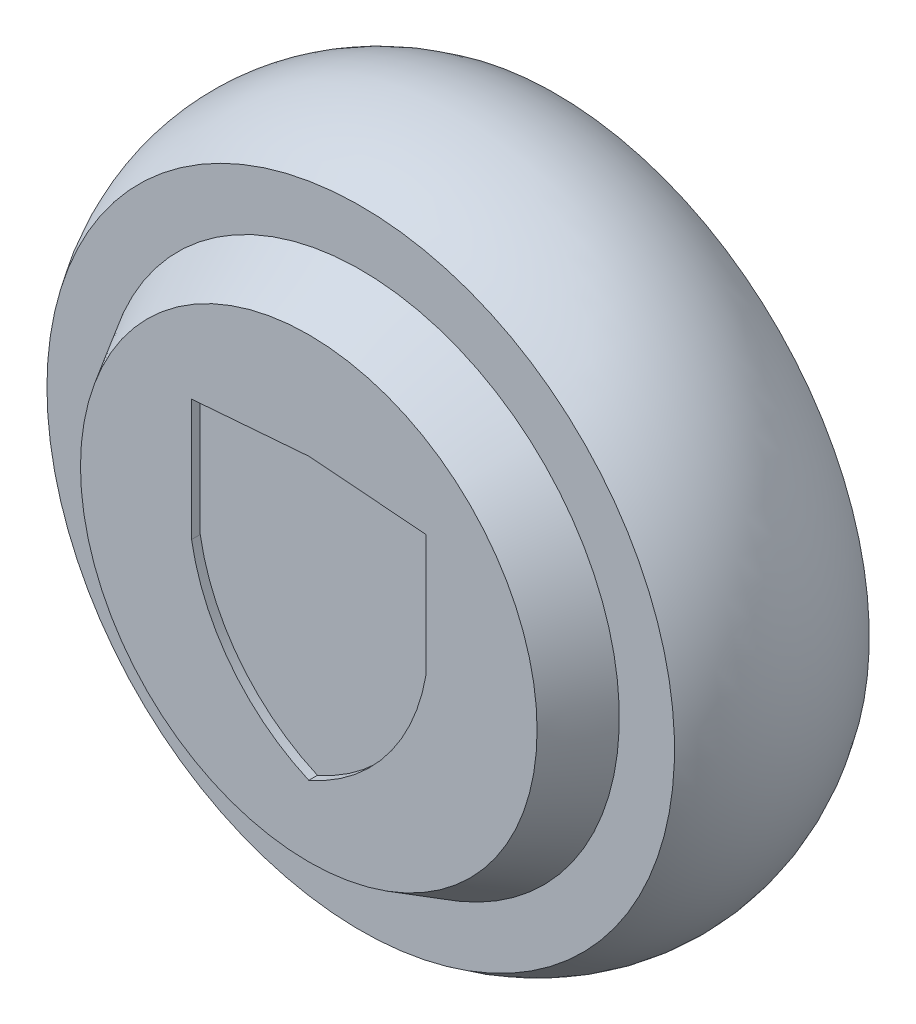
ISO-10303-21;
HEADER;
FILE_DESCRIPTION(('STEP AP214'),'2;1');
FILE_NAME('part.step','',(''),(''),'','','');
FILE_SCHEMA(('AUTOMOTIVE_DESIGN { 1 0 10303 214 1 1 1 1 }'));
ENDSEC;
DATA;
#1=APPLICATION_CONTEXT('core data for automotive mechanical design processes');
#2=APPLICATION_PROTOCOL_DEFINITION('international standard','automotive_design',2000,#1);
#3=PRODUCT_CONTEXT('',#1,'mechanical');
#4=PRODUCT('Part','Part','',(#3));
#5=PRODUCT_RELATED_PRODUCT_CATEGORY('part','',(#4));
#6=PRODUCT_DEFINITION_FORMATION('','',#4);
#7=PRODUCT_DEFINITION_CONTEXT('part definition',#1,'design');
#8=PRODUCT_DEFINITION('design','',#6,#7);
#9=PRODUCT_DEFINITION_SHAPE('','',#8);
#10=(LENGTH_UNIT() NAMED_UNIT(*) SI_UNIT(.MILLI.,.METRE.));
#11=(NAMED_UNIT(*) PLANE_ANGLE_UNIT() SI_UNIT($,.RADIAN.));
#12=(NAMED_UNIT(*) SI_UNIT($,.STERADIAN.) SOLID_ANGLE_UNIT());
#13=UNCERTAINTY_MEASURE_WITH_UNIT(LENGTH_MEASURE(1.E-05),#10,'distance_accuracy_value','');
#14=(GEOMETRIC_REPRESENTATION_CONTEXT(3) GLOBAL_UNCERTAINTY_ASSIGNED_CONTEXT((#13)) GLOBAL_UNIT_ASSIGNED_CONTEXT((#10,
#11,#12)) REPRESENTATION_CONTEXT('',''));
#15=CARTESIAN_POINT('',(0.,0.,0.));
#16=DIRECTION('',(0.,0.,1.));
#17=DIRECTION('',(1.,0.,0.));
#18=AXIS2_PLACEMENT_3D('',#15,#16,#17);
#19=CARTESIAN_POINT('',(0.,0.,-22.5));
#20=DIRECTION('',(0.,0.,1.));
#21=DIRECTION('',(1.,0.,0.));
#22=AXIS2_PLACEMENT_3D('',#19,#20,#21);
#23=PLANE('',#22);
#24=CARTESIAN_POINT('',(0.,0.,-22.5));
#25=DIRECTION('',(0.,0.,-1.));
#26=DIRECTION('',(-1.,0.,0.));
#27=AXIS2_PLACEMENT_3D('',#24,#25,#26);
#28=CIRCLE('',#27,67.5);
#29=CARTESIAN_POINT('',(-67.5,0.,-22.5));
#30=VERTEX_POINT('',#29);
#31=EDGE_CURVE('E155',#30,#30,#28,.T.);
#32=ORIENTED_EDGE('',*,*,#31,.F.);
#33=EDGE_LOOP('',(#32));
#34=FACE_BOUND('',#33,.T.);
#35=CARTESIAN_POINT('',(0.,0.,-22.5));
#36=DIRECTION('',(0.,0.,-1.));
#37=DIRECTION('',(-1.,0.,0.));
#38=AXIS2_PLACEMENT_3D('',#35,#36,#37);
#39=CIRCLE('',#38,72.5);
#40=CARTESIAN_POINT('',(-72.5,0.,-22.5));
#41=VERTEX_POINT('',#40);
#42=EDGE_CURVE('E148',#41,#41,#39,.T.);
#43=ORIENTED_EDGE('',*,*,#42,.T.);
#44=EDGE_LOOP('',(#43));
#45=FACE_BOUND('',#44,.T.);
#46=ADVANCED_FACE('F39',(#34,#45),#23,.F.);
#47=CARTESIAN_POINT('',(0.,0.,-18.5));
#48=DIRECTION('',(0.,0.,-1.));
#49=DIRECTION('',(-1.,0.,0.));
#50=AXIS2_PLACEMENT_3D('',#47,#48,#49);
#51=CYLINDRICAL_SURFACE('',#50,67.5);
#52=CARTESIAN_POINT('',(0.,0.,-18.5));
#53=DIRECTION('',(0.,0.,-1.));
#54=DIRECTION('',(-1.,0.,0.));
#55=AXIS2_PLACEMENT_3D('',#52,#53,#54);
#56=CIRCLE('',#55,67.5);
#57=CARTESIAN_POINT('',(-67.5,0.,-18.5));
#58=VERTEX_POINT('',#57);
#59=EDGE_CURVE('E158',#58,#58,#56,.T.);
#60=ORIENTED_EDGE('',*,*,#59,.F.);
#61=EDGE_LOOP('',(#60));
#62=FACE_BOUND('',#61,.T.);
#63=ORIENTED_EDGE('',*,*,#31,.T.);
#64=EDGE_LOOP('',(#63));
#65=FACE_BOUND('',#64,.T.);
#66=ADVANCED_FACE('F186',(#62,#65),#51,.F.);
#67=CARTESIAN_POINT('',(0.,0.,-18.5));
#68=DIRECTION('',(0.,0.,-1.));
#69=DIRECTION('',(-1.,0.,0.));
#70=AXIS2_PLACEMENT_3D('',#67,#68,#69);
#71=PLANE('',#70);
#72=CARTESIAN_POINT('',(0.,0.,-18.5));
#73=DIRECTION('',(0.,0.,-1.));
#74=DIRECTION('',(-1.,0.,0.));
#75=AXIS2_PLACEMENT_3D('',#72,#73,#74);
#76=CIRCLE('',#75,52.);
#77=CARTESIAN_POINT('',(-52.,0.,-18.5));
#78=VERTEX_POINT('',#77);
#79=EDGE_CURVE('E151',#78,#78,#76,.T.);
#80=ORIENTED_EDGE('',*,*,#79,.F.);
#81=EDGE_LOOP('',(#80));
#82=FACE_BOUND('',#81,.T.);
#83=ORIENTED_EDGE('',*,*,#59,.T.);
#84=EDGE_LOOP('',(#83));
#85=FACE_BOUND('',#84,.T.);
#86=ADVANCED_FACE('F191',(#82,#85),#71,.T.);
#87=CARTESIAN_POINT('',(0.,0.,29.5));
#88=DIRECTION('',(0.,0.,-1.));
#89=DIRECTION('',(-1.,0.,0.));
#90=AXIS2_PLACEMENT_3D('',#87,#88,#89);
#91=CYLINDRICAL_SURFACE('',#90,52.);
#92=CARTESIAN_POINT('',(0.,0.,29.5));
#93=DIRECTION('',(0.,0.,-1.));
#94=DIRECTION('',(-1.,0.,0.));
#95=AXIS2_PLACEMENT_3D('',#92,#93,#94);
#96=CIRCLE('',#95,52.);
#97=CARTESIAN_POINT('',(-52.,0.,29.5));
#98=VERTEX_POINT('',#97);
#99=EDGE_CURVE('E152',#98,#98,#96,.T.);
#100=ORIENTED_EDGE('',*,*,#99,.F.);
#101=EDGE_LOOP('',(#100));
#102=FACE_BOUND('',#101,.T.);
#103=ORIENTED_EDGE('',*,*,#79,.T.);
#104=EDGE_LOOP('',(#103));
#105=FACE_BOUND('',#104,.T.);
#106=ADVANCED_FACE('F216',(#102,#105),#91,.F.);
#107=CARTESIAN_POINT('',(0.,0.,29.5));
#108=DIRECTION('',(0.,0.,-1.));
#109=DIRECTION('',(-1.,0.,0.));
#110=AXIS2_PLACEMENT_3D('',#107,#108,#109);
#111=PLANE('',#110);
#112=ORIENTED_EDGE('',*,*,#99,.T.);
#113=EDGE_LOOP('',(#112));
#114=FACE_BOUND('',#113,.T.);
#115=ADVANCED_FACE('F181',(#114),#111,.T.);
#116=CARTESIAN_POINT('',(0.,0.,0.));
#117=DIRECTION('',(0.,0.,-1.));
#118=DIRECTION('',(-1.,0.,0.));
#119=AXIS2_PLACEMENT_3D('',#116,#117,#118);
#120=TOROIDAL_SURFACE('',#119,41.2112068965518,38.5387931034482);
#121=ORIENTED_EDGE('',*,*,#42,.F.);
#122=EDGE_LOOP('',(#121));
#123=FACE_BOUND('',#122,.T.);
#124=CARTESIAN_POINT('',(0.,0.,22.5));
#125=DIRECTION('',(0.,0.,-1.));
#126=DIRECTION('',(-1.,0.,0.));
#127=AXIS2_PLACEMENT_3D('',#124,#125,#126);
#128=CIRCLE('',#127,72.5);
#129=CARTESIAN_POINT('',(-72.5,0.,22.5));
#130=VERTEX_POINT('',#129);
#131=EDGE_CURVE('E140',#130,#130,#128,.T.);
#132=ORIENTED_EDGE('',*,*,#131,.T.);
#133=EDGE_LOOP('',(#132));
#134=FACE_BOUND('',#133,.T.);
#135=ADVANCED_FACE('F170',(#123,#134),#120,.T.);
#136=CARTESIAN_POINT('',(0.,52.75,34.5));
#137=DIRECTION('',(0.,0.,1.));
#138=DIRECTION('',(1.,0.,0.));
#139=AXIS2_PLACEMENT_3D('',#136,#137,#138);
#140=PLANE('',#139);
#141=DIRECTION('',(0.,-1.,0.));
#142=VECTOR('',#141,1.);
#143=CARTESIAN_POINT('',(-27.0800410810947,26.3184149256891,34.5));
#144=LINE('',#143,#142);
#145=CARTESIAN_POINT('',(-27.0800410810947,26.3184149256891,34.5));
#146=VERTEX_POINT('',#145);
#147=CARTESIAN_POINT('',(-27.0800410810947,-1.78158165007186,34.5));
#148=VERTEX_POINT('',#147);
#149=EDGE_CURVE('E53',#146,#148,#144,.T.);
#150=ORIENTED_EDGE('',*,*,#149,.F.);
#151=DIRECTION('',(-0.996962141349244,-0.0778876672929092,0.));
#152=VECTOR('',#151,1.);
#153=CARTESIAN_POINT('',(-27.0800410810947,26.3184149256891,34.5));
#154=LINE('',#153,#152);
#155=CARTESIAN_POINT('',(1.66226703810826E-13,28.4340431351496,34.5));
#156=VERTEX_POINT('',#155);
#157=EDGE_CURVE('E136',#156,#146,#154,.T.);
#158=ORIENTED_EDGE('',*,*,#157,.F.);
#159=DIRECTION('',(-0.996962141349245,0.0778876672928885,0.));
#160=VECTOR('',#159,1.);
#161=CARTESIAN_POINT('',(27.0800410810951,26.3184149256897,34.5));
#162=LINE('',#161,#160);
#163=CARTESIAN_POINT('',(27.0800410810951,26.3184149256897,34.5));
#164=VERTEX_POINT('',#163);
#165=EDGE_CURVE('E134',#164,#156,#162,.T.);
#166=ORIENTED_EDGE('',*,*,#165,.F.);
#167=DIRECTION('',(0.,1.,0.));
#168=VECTOR('',#167,1.);
#169=CARTESIAN_POINT('',(27.0800410810951,26.3184149256897,34.5));
#170=LINE('',#169,#168);
#171=CARTESIAN_POINT('',(27.0800410810957,-1.7815816500713,34.5));
#172=VERTEX_POINT('',#171);
#173=EDGE_CURVE('E101',#172,#164,#170,.T.);
#174=ORIENTED_EDGE('',*,*,#173,.F.);
#175=CARTESIAN_POINT('',(-18.5615106399573,6.00140736265174,34.5));
#176=DIRECTION('',(0.,0.,1.));
#177=DIRECTION('',(-1.,0.,0.));
#178=AXIS2_PLACEMENT_3D('',#175,#176,#177);
#179=CIRCLE('',#178,46.3003905110712);
#180=CARTESIAN_POINT('',(1.45716771982052E-13,-36.4155289274723,34.5));
#181=VERTEX_POINT('',#180);
#182=EDGE_CURVE('E130',#181,#172,#179,.T.);
#183=ORIENTED_EDGE('',*,*,#182,.F.);
#184=CARTESIAN_POINT('',(18.5615106399581,6.00140736265212,34.5));
#185=DIRECTION('',(0.,0.,1.));
#186=DIRECTION('',(1.,0.,0.));
#187=AXIS2_PLACEMENT_3D('',#184,#185,#186);
#188=CIRCLE('',#187,46.3003905110716);
#189=EDGE_CURVE('E127',#148,#181,#188,.T.);
#190=ORIENTED_EDGE('',*,*,#189,.F.);
#191=EDGE_LOOP('',(#150,#158,#166,#174,#183,#190));
#192=FACE_BOUND('',#191,.T.);
#193=CARTESIAN_POINT('',(0.,0.,34.5));
#194=DIRECTION('',(0.,0.,-1.));
#195=DIRECTION('',(-1.,0.,0.));
#196=AXIS2_PLACEMENT_3D('',#193,#194,#195);
#197=CIRCLE('',#196,52.75);
#198=CARTESIAN_POINT('',(-52.75,0.,34.5));
#199=VERTEX_POINT('',#198);
#200=EDGE_CURVE('E46',#199,#199,#197,.T.);
#201=ORIENTED_EDGE('',*,*,#200,.F.);
#202=EDGE_LOOP('',(#201));
#203=FACE_BOUND('',#202,.T.);
#204=ADVANCED_FACE('F168',(#192,#203),#140,.T.);
#205=CARTESIAN_POINT('',(0.,0.,22.5));
#206=DIRECTION('',(0.,0.,-1.));
#207=DIRECTION('',(-1.,0.,0.));
#208=AXIS2_PLACEMENT_3D('',#205,#206,#207);
#209=CONICAL_SURFACE('',#208,59.75,0.52807444842636);
#210=ORIENTED_EDGE('',*,*,#200,.T.);
#211=EDGE_LOOP('',(#210));
#212=FACE_BOUND('',#211,.T.);
#213=CARTESIAN_POINT('',(0.,0.,22.5));
#214=DIRECTION('',(0.,0.,-1.));
#215=DIRECTION('',(-1.,0.,0.));
#216=AXIS2_PLACEMENT_3D('',#213,#214,#215);
#217=CIRCLE('',#216,59.75);
#218=CARTESIAN_POINT('',(-59.75,0.,22.5));
#219=VERTEX_POINT('',#218);
#220=EDGE_CURVE('E11',#219,#219,#217,.T.);
#221=ORIENTED_EDGE('',*,*,#220,.F.);
#222=EDGE_LOOP('',(#221));
#223=FACE_BOUND('',#222,.T.);
#224=ADVANCED_FACE('F165',(#212,#223),#209,.T.);
#225=CARTESIAN_POINT('',(0.,0.,22.5));
#226=DIRECTION('',(0.,0.,1.));
#227=DIRECTION('',(1.,0.,0.));
#228=AXIS2_PLACEMENT_3D('',#225,#226,#227);
#229=PLANE('',#228);
#230=ORIENTED_EDGE('',*,*,#220,.T.);
#231=EDGE_LOOP('',(#230));
#232=FACE_BOUND('',#231,.T.);
#233=ORIENTED_EDGE('',*,*,#131,.F.);
#234=EDGE_LOOP('',(#233));
#235=FACE_BOUND('',#234,.T.);
#236=ADVANCED_FACE('F178',(#232,#235),#229,.T.);
#237=CARTESIAN_POINT('',(-27.0800410810947,26.3184149256891,32.5));
#238=DIRECTION('',(-1.,0.,0.));
#239=DIRECTION('',(0.,-1.,0.));
#240=AXIS2_PLACEMENT_3D('',#237,#238,#239);
#241=PLANE('',#240);
#242=ORIENTED_EDGE('',*,*,#149,.T.);
#243=DIRECTION('',(0.,0.,1.));
#244=VECTOR('',#243,1.);
#245=CARTESIAN_POINT('',(-27.0800410810947,-1.78158165007186,32.5));
#246=LINE('',#245,#244);
#247=CARTESIAN_POINT('',(-27.0800410810947,-1.78158165007186,32.5));
#248=VERTEX_POINT('',#247);
#249=EDGE_CURVE('E83',#248,#148,#246,.T.);
#250=ORIENTED_EDGE('',*,*,#249,.F.);
#251=DIRECTION('',(0.,-1.,0.));
#252=VECTOR('',#251,1.);
#253=CARTESIAN_POINT('',(-27.0800410810947,26.3184149256891,32.5));
#254=LINE('',#253,#252);
#255=CARTESIAN_POINT('',(-27.0800410810947,26.3184149256891,32.5));
#256=VERTEX_POINT('',#255);
#257=EDGE_CURVE('E138',#256,#248,#254,.T.);
#258=ORIENTED_EDGE('',*,*,#257,.F.);
#259=DIRECTION('',(0.,0.,1.));
#260=VECTOR('',#259,1.);
#261=CARTESIAN_POINT('',(-27.0800410810947,26.3184149256891,32.5));
#262=LINE('',#261,#260);
#263=EDGE_CURVE('E61',#256,#146,#262,.T.);
#264=ORIENTED_EDGE('',*,*,#263,.T.);
#265=EDGE_LOOP('',(#242,#250,#258,#264));
#266=FACE_BOUND('',#265,.T.);
#267=ADVANCED_FACE('F200',(#266),#241,.F.);
#268=CARTESIAN_POINT('',(-27.0800410810947,26.3184149256891,32.5));
#269=DIRECTION('',(-0.0778876672929092,0.996962141349244,0.));
#270=DIRECTION('',(-0.996962141349244,-0.0778876672929092,0.));
#271=AXIS2_PLACEMENT_3D('',#268,#269,#270);
#272=PLANE('',#271);
#273=ORIENTED_EDGE('',*,*,#157,.T.);
#274=ORIENTED_EDGE('',*,*,#263,.F.);
#275=DIRECTION('',(-0.996962141349244,-0.0778876672929092,0.));
#276=VECTOR('',#275,1.);
#277=CARTESIAN_POINT('',(-27.0800410810947,26.3184149256891,32.5));
#278=LINE('',#277,#276);
#279=CARTESIAN_POINT('',(1.66226703810826E-13,28.4340431351496,32.5));
#280=VERTEX_POINT('',#279);
#281=EDGE_CURVE('E113',#280,#256,#278,.T.);
#282=ORIENTED_EDGE('',*,*,#281,.F.);
#283=DIRECTION('',(0.,0.,1.));
#284=VECTOR('',#283,1.);
#285=CARTESIAN_POINT('',(1.66226703810826E-13,28.4340431351496,32.5));
#286=LINE('',#285,#284);
#287=EDGE_CURVE('E105',#280,#156,#286,.T.);
#288=ORIENTED_EDGE('',*,*,#287,.T.);
#289=EDGE_LOOP('',(#273,#274,#282,#288));
#290=FACE_BOUND('',#289,.T.);
#291=ADVANCED_FACE('F204',(#290),#272,.F.);
#292=CARTESIAN_POINT('',(27.0800410810951,26.3184149256897,32.5));
#293=DIRECTION('',(0.0778876672928885,0.996962141349245,0.));
#294=DIRECTION('',(-0.996962141349245,0.0778876672928885,0.));
#295=AXIS2_PLACEMENT_3D('',#292,#293,#294);
#296=PLANE('',#295);
#297=ORIENTED_EDGE('',*,*,#165,.T.);
#298=ORIENTED_EDGE('',*,*,#287,.F.);
#299=DIRECTION('',(-0.996962141349245,0.0778876672928885,0.));
#300=VECTOR('',#299,1.);
#301=CARTESIAN_POINT('',(27.0800410810951,26.3184149256897,32.5));
#302=LINE('',#301,#300);
#303=CARTESIAN_POINT('',(27.0800410810951,26.3184149256897,32.5));
#304=VERTEX_POINT('',#303);
#305=EDGE_CURVE('E109',#304,#280,#302,.T.);
#306=ORIENTED_EDGE('',*,*,#305,.F.);
#307=DIRECTION('',(0.,0.,1.));
#308=VECTOR('',#307,1.);
#309=CARTESIAN_POINT('',(27.0800410810951,26.3184149256897,32.5));
#310=LINE('',#309,#308);
#311=EDGE_CURVE('E94',#304,#164,#310,.T.);
#312=ORIENTED_EDGE('',*,*,#311,.T.);
#313=EDGE_LOOP('',(#297,#298,#306,#312));
#314=FACE_BOUND('',#313,.T.);
#315=ADVANCED_FACE('F110',(#314),#296,.F.);
#316=CARTESIAN_POINT('',(27.0800410810951,26.3184149256897,32.5));
#317=DIRECTION('',(1.,0.,0.));
#318=DIRECTION('',(0.,1.,0.));
#319=AXIS2_PLACEMENT_3D('',#316,#317,#318);
#320=PLANE('',#319);
#321=ORIENTED_EDGE('',*,*,#173,.T.);
#322=ORIENTED_EDGE('',*,*,#311,.F.);
#323=DIRECTION('',(0.,1.,0.));
#324=VECTOR('',#323,1.);
#325=CARTESIAN_POINT('',(27.0800410810951,26.3184149256897,32.5));
#326=LINE('',#325,#324);
#327=CARTESIAN_POINT('',(27.0800410810957,-1.7815816500713,32.5));
#328=VERTEX_POINT('',#327);
#329=EDGE_CURVE('E98',#328,#304,#326,.T.);
#330=ORIENTED_EDGE('',*,*,#329,.F.);
#331=DIRECTION('',(0.,0.,1.));
#332=VECTOR('',#331,1.);
#333=CARTESIAN_POINT('',(27.0800410810957,-1.7815816500713,32.5));
#334=LINE('',#333,#332);
#335=EDGE_CURVE('E106',#328,#172,#334,.T.);
#336=ORIENTED_EDGE('',*,*,#335,.T.);
#337=EDGE_LOOP('',(#321,#322,#330,#336));
#338=FACE_BOUND('',#337,.T.);
#339=ADVANCED_FACE('F96',(#338),#320,.F.);
#340=CARTESIAN_POINT('',(-18.5615106399573,6.00140736265174,32.5));
#341=DIRECTION('',(0.,0.,1.));
#342=DIRECTION('',(1.,0.,0.));
#343=AXIS2_PLACEMENT_3D('',#340,#341,#342);
#344=CYLINDRICAL_SURFACE('',#343,46.3003905110712);
#345=ORIENTED_EDGE('',*,*,#182,.T.);
#346=ORIENTED_EDGE('',*,*,#335,.F.);
#347=CARTESIAN_POINT('',(-18.5615106399573,6.00140736265174,32.5));
#348=DIRECTION('',(0.,0.,1.));
#349=DIRECTION('',(-1.,0.,0.));
#350=AXIS2_PLACEMENT_3D('',#347,#348,#349);
#351=CIRCLE('',#350,46.3003905110712);
#352=CARTESIAN_POINT('',(1.45716771982052E-13,-36.4155289274723,32.5));
#353=VERTEX_POINT('',#352);
#354=EDGE_CURVE('E119',#353,#328,#351,.T.);
#355=ORIENTED_EDGE('',*,*,#354,.F.);
#356=DIRECTION('',(0.,0.,1.));
#357=VECTOR('',#356,1.);
#358=CARTESIAN_POINT('',(1.45716771982052E-13,-36.4155289274723,32.5));
#359=LINE('',#358,#357);
#360=EDGE_CURVE('E143',#353,#181,#359,.T.);
#361=ORIENTED_EDGE('',*,*,#360,.T.);
#362=EDGE_LOOP('',(#345,#346,#355,#361));
#363=FACE_BOUND('',#362,.T.);
#364=ADVANCED_FACE('F319',(#363),#344,.F.);
#365=CARTESIAN_POINT('',(18.5615106399581,6.00140736265212,32.5));
#366=DIRECTION('',(0.,0.,1.));
#367=DIRECTION('',(1.,0.,0.));
#368=AXIS2_PLACEMENT_3D('',#365,#366,#367);
#369=CYLINDRICAL_SURFACE('',#368,46.3003905110716);
#370=ORIENTED_EDGE('',*,*,#189,.T.);
#371=ORIENTED_EDGE('',*,*,#360,.F.);
#372=CARTESIAN_POINT('',(18.5615106399581,6.00140736265212,32.5));
#373=DIRECTION('',(0.,0.,1.));
#374=DIRECTION('',(1.,0.,0.));
#375=AXIS2_PLACEMENT_3D('',#372,#373,#374);
#376=CIRCLE('',#375,46.3003905110716);
#377=EDGE_CURVE('E121',#248,#353,#376,.T.);
#378=ORIENTED_EDGE('',*,*,#377,.F.);
#379=ORIENTED_EDGE('',*,*,#249,.T.);
#380=EDGE_LOOP('',(#370,#371,#378,#379));
#381=FACE_BOUND('',#380,.T.);
#382=ADVANCED_FACE('F211',(#381),#369,.F.);
#383=CARTESIAN_POINT('',(18.5615106399581,6.00140736265212,32.5));
#384=DIRECTION('',(0.,0.,1.));
#385=DIRECTION('',(1.,0.,0.));
#386=AXIS2_PLACEMENT_3D('',#383,#384,#385);
#387=PLANE('',#386);
#388=ORIENTED_EDGE('',*,*,#257,.T.);
#389=ORIENTED_EDGE('',*,*,#377,.T.);
#390=ORIENTED_EDGE('',*,*,#354,.T.);
#391=ORIENTED_EDGE('',*,*,#329,.T.);
#392=ORIENTED_EDGE('',*,*,#305,.T.);
#393=ORIENTED_EDGE('',*,*,#281,.T.);
#394=EDGE_LOOP('',(#388,#389,#390,#391,#392,#393));
#395=FACE_BOUND('',#394,.T.);
#396=ADVANCED_FACE('F116',(#395),#387,.T.);
#397=CLOSED_SHELL('',(#46,#66,#86,#106,#115,#135,#204,#224,#236,#267,#291,#315,#339,#364,#382,#396));
#398=MANIFOLD_SOLID_BREP('B2',#397);
#399=ADVANCED_BREP_SHAPE_REPRESENTATION('',(#18,#398),#14);
#400=SHAPE_DEFINITION_REPRESENTATION(#9,#399);
ENDSEC;
END-ISO-10303-21;
